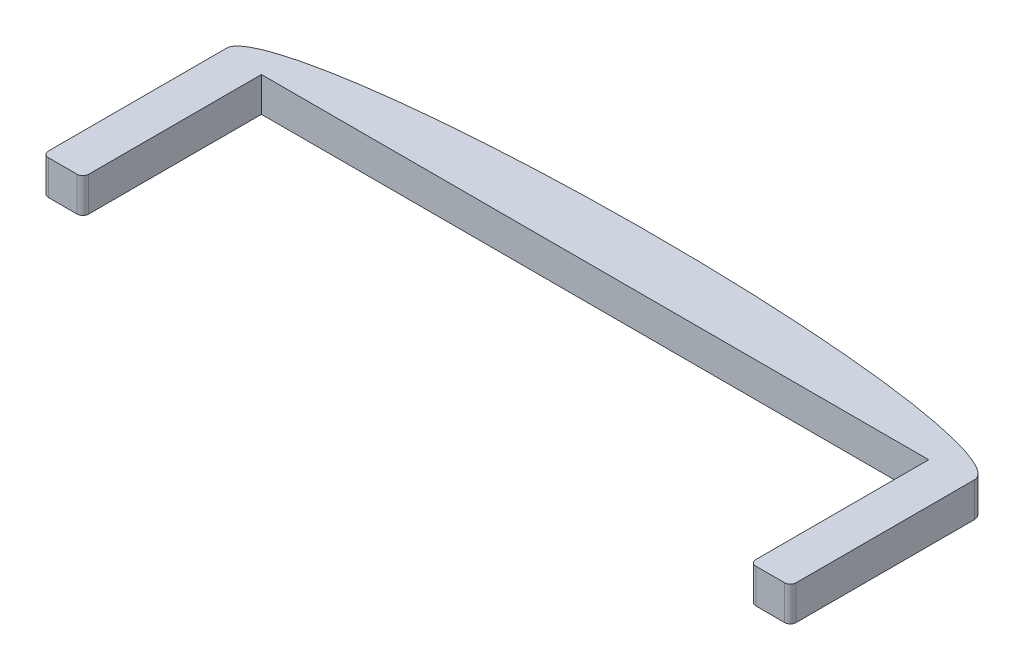
ISO-10303-21;
HEADER;
FILE_DESCRIPTION(('STEP AP214'),'2;1');
FILE_NAME('part.step','',(''),(''),'','','');
FILE_SCHEMA(('AUTOMOTIVE_DESIGN { 1 0 10303 214 1 1 1 1 }'));
ENDSEC;
DATA;
#1=APPLICATION_CONTEXT('core data for automotive mechanical design processes');
#2=APPLICATION_PROTOCOL_DEFINITION('international standard','automotive_design',2000,#1);
#3=PRODUCT_CONTEXT('',#1,'mechanical');
#4=PRODUCT('Part','Part','',(#3));
#5=PRODUCT_RELATED_PRODUCT_CATEGORY('part','',(#4));
#6=PRODUCT_DEFINITION_FORMATION('','',#4);
#7=PRODUCT_DEFINITION_CONTEXT('part definition',#1,'design');
#8=PRODUCT_DEFINITION('design','',#6,#7);
#9=PRODUCT_DEFINITION_SHAPE('','',#8);
#10=(LENGTH_UNIT() NAMED_UNIT(*) SI_UNIT(.MILLI.,.METRE.));
#11=(NAMED_UNIT(*) PLANE_ANGLE_UNIT() SI_UNIT($,.RADIAN.));
#12=(NAMED_UNIT(*) SI_UNIT($,.STERADIAN.) SOLID_ANGLE_UNIT());
#13=UNCERTAINTY_MEASURE_WITH_UNIT(LENGTH_MEASURE(1.E-05),#10,'distance_accuracy_value','');
#14=(GEOMETRIC_REPRESENTATION_CONTEXT(3) GLOBAL_UNCERTAINTY_ASSIGNED_CONTEXT((#13)) GLOBAL_UNIT_ASSIGNED_CONTEXT((#10,
#11,#12)) REPRESENTATION_CONTEXT('',''));
#15=CARTESIAN_POINT('',(0.,0.,0.));
#16=DIRECTION('',(0.,0.,1.));
#17=DIRECTION('',(1.,0.,0.));
#18=AXIS2_PLACEMENT_3D('',#15,#16,#17);
#19=CARTESIAN_POINT('',(0.,3.,0.));
#20=DIRECTION('',(0.,0.,-1.));
#21=DIRECTION('',(-1.,0.,0.));
#22=AXIS2_PLACEMENT_3D('',#19,#20,#21);
#23=PLANE('',#22);
#24=DIRECTION('',(1.,0.,0.));
#25=VECTOR('',#24,1.);
#26=CARTESIAN_POINT('',(0.,3.,0.));
#27=LINE('',#26,#25);
#28=CARTESIAN_POINT('',(29.5,3.,0.));
#29=VERTEX_POINT('',#28);
#30=CARTESIAN_POINT('',(32.,3.,0.));
#31=VERTEX_POINT('',#30);
#32=EDGE_CURVE('E237',#29,#31,#27,.T.);
#33=ORIENTED_EDGE('',*,*,#32,.F.);
#34=DIRECTION('',(0.,-1.,0.));
#35=VECTOR('',#34,1.);
#36=CARTESIAN_POINT('',(29.5,3.,0.));
#37=LINE('',#36,#35);
#38=CARTESIAN_POINT('',(29.5,0.,0.));
#39=VERTEX_POINT('',#38);
#40=EDGE_CURVE('E43',#29,#39,#37,.T.);
#41=ORIENTED_EDGE('',*,*,#40,.T.);
#42=DIRECTION('',(1.,0.,0.));
#43=VECTOR('',#42,1.);
#44=CARTESIAN_POINT('',(0.,0.,0.));
#45=LINE('',#44,#43);
#46=CARTESIAN_POINT('',(32.,0.,0.));
#47=VERTEX_POINT('',#46);
#48=EDGE_CURVE('E223',#39,#47,#45,.T.);
#49=ORIENTED_EDGE('',*,*,#48,.T.);
#50=DIRECTION('',(0.,-1.,0.));
#51=VECTOR('',#50,1.);
#52=CARTESIAN_POINT('',(32.,3.,0.));
#53=LINE('',#52,#51);
#54=EDGE_CURVE('E256',#47,#31,#53,.F.);
#55=ORIENTED_EDGE('',*,*,#54,.T.);
#56=EDGE_LOOP('',(#33,#41,#49,#55));
#57=FACE_BOUND('',#56,.T.);
#58=ADVANCED_FACE('F35',(#57),#23,.F.);
#59=CARTESIAN_POINT('',(0.,3.,-16.));
#60=DIRECTION('',(0.,1.,0.));
#61=DIRECTION('',(-1.,0.,0.));
#62=AXIS2_PLACEMENT_3D('',#59,#60,#61);
#63=ELLIPSE('',#62,32.5,4.5);
#64=DIRECTION('',(0.,-1.,0.));
#65=VECTOR('',#64,1.);
#66=SURFACE_OF_LINEAR_EXTRUSION('',#63,#65);
#67=CARTESIAN_POINT('',(0.,0.,-16.));
#68=DIRECTION('',(0.,1.,0.));
#69=DIRECTION('',(-1.,0.,0.));
#70=AXIS2_PLACEMENT_3D('',#67,#68,#69);
#71=ELLIPSE('',#70,32.5,4.5);
#72=CARTESIAN_POINT('',(32.5,0.,-16.));
#73=VERTEX_POINT('',#72);
#74=CARTESIAN_POINT('',(-32.5,0.,-16.));
#75=VERTEX_POINT('',#74);
#76=EDGE_CURVE('E165',#73,#75,#71,.T.);
#77=ORIENTED_EDGE('',*,*,#76,.T.);
#78=DIRECTION('',(0.,-1.,0.));
#79=VECTOR('',#78,1.);
#80=CARTESIAN_POINT('',(-32.5,3.,-16.));
#81=LINE('',#80,#79);
#82=CARTESIAN_POINT('',(-32.5,3.,-16.));
#83=VERTEX_POINT('',#82);
#84=EDGE_CURVE('E246',#83,#75,#81,.T.);
#85=ORIENTED_EDGE('',*,*,#84,.F.);
#86=CARTESIAN_POINT('',(32.5,3.,-16.));
#87=VERTEX_POINT('',#86);
#88=EDGE_CURVE('E166',#87,#83,#63,.T.);
#89=ORIENTED_EDGE('',*,*,#88,.F.);
#90=DIRECTION('',(0.,-1.,0.));
#91=VECTOR('',#90,1.);
#92=CARTESIAN_POINT('',(32.5,3.,-16.));
#93=LINE('',#92,#91);
#94=EDGE_CURVE('E160',#87,#73,#93,.T.);
#95=ORIENTED_EDGE('',*,*,#94,.T.);
#96=EDGE_LOOP('',(#77,#85,#89,#95));
#97=FACE_BOUND('',#96,.T.);
#98=ADVANCED_FACE('F173',(#97),#66,.F.);
#99=CARTESIAN_POINT('',(-32.5,3.,0.));
#100=DIRECTION('',(1.,0.,0.));
#101=DIRECTION('',(0.,0.,-1.));
#102=AXIS2_PLACEMENT_3D('',#99,#100,#101);
#103=PLANE('',#102);
#104=DIRECTION('',(0.,0.,1.));
#105=VECTOR('',#104,1.);
#106=CARTESIAN_POINT('',(-32.5,0.,0.));
#107=LINE('',#106,#105);
#108=CARTESIAN_POINT('',(-32.5,0.,-0.499999999999996));
#109=VERTEX_POINT('',#108);
#110=EDGE_CURVE('E241',#75,#109,#107,.T.);
#111=ORIENTED_EDGE('',*,*,#110,.T.);
#112=DIRECTION('',(0.,-1.,0.));
#113=VECTOR('',#112,1.);
#114=CARTESIAN_POINT('',(-32.5,3.,-0.499999999999996));
#115=LINE('',#114,#113);
#116=CARTESIAN_POINT('',(-32.5,3.,-0.499999999999996));
#117=VERTEX_POINT('',#116);
#118=EDGE_CURVE('E263',#109,#117,#115,.F.);
#119=ORIENTED_EDGE('',*,*,#118,.T.);
#120=DIRECTION('',(0.,0.,1.));
#121=VECTOR('',#120,1.);
#122=CARTESIAN_POINT('',(-32.5,3.,0.));
#123=LINE('',#122,#121);
#124=EDGE_CURVE('E169',#83,#117,#123,.T.);
#125=ORIENTED_EDGE('',*,*,#124,.F.);
#126=ORIENTED_EDGE('',*,*,#84,.T.);
#127=EDGE_LOOP('',(#111,#119,#125,#126));
#128=FACE_BOUND('',#127,.T.);
#129=ADVANCED_FACE('F177',(#128),#103,.F.);
#130=CARTESIAN_POINT('',(-32.,0.,0.));
#131=VERTEX_POINT('',#130);
#132=CARTESIAN_POINT('',(-29.5,0.,0.));
#133=VERTEX_POINT('',#132);
#134=EDGE_CURVE('E170',#131,#133,#45,.T.);
#135=ORIENTED_EDGE('',*,*,#134,.T.);
#136=DIRECTION('',(0.,-1.,0.));
#137=VECTOR('',#136,1.);
#138=CARTESIAN_POINT('',(-29.5,3.,0.));
#139=LINE('',#138,#137);
#140=CARTESIAN_POINT('',(-29.5,3.,0.));
#141=VERTEX_POINT('',#140);
#142=EDGE_CURVE('E219',#133,#141,#139,.F.);
#143=ORIENTED_EDGE('',*,*,#142,.T.);
#144=CARTESIAN_POINT('',(-32.,3.,0.));
#145=VERTEX_POINT('',#144);
#146=EDGE_CURVE('E250',#145,#141,#27,.T.);
#147=ORIENTED_EDGE('',*,*,#146,.F.);
#148=DIRECTION('',(0.,-1.,0.));
#149=VECTOR('',#148,1.);
#150=CARTESIAN_POINT('',(-32.,3.,0.));
#151=LINE('',#150,#149);
#152=EDGE_CURVE('E221',#145,#131,#151,.T.);
#153=ORIENTED_EDGE('',*,*,#152,.T.);
#154=EDGE_LOOP('',(#135,#143,#147,#153));
#155=FACE_BOUND('',#154,.T.);
#156=ADVANCED_FACE('F200',(#155),#23,.F.);
#157=CARTESIAN_POINT('',(0.,3.,-16.));
#158=DIRECTION('',(0.,1.,0.));
#159=DIRECTION('',(0.,0.,1.));
#160=AXIS2_PLACEMENT_3D('',#157,#158,#159);
#161=PLANE('',#160);
#162=ORIENTED_EDGE('',*,*,#146,.T.);
#163=CARTESIAN_POINT('',(-29.5,3.,-0.499999999999996));
#164=DIRECTION('',(0.,1.,0.));
#165=DIRECTION('',(0.,0.,1.));
#166=AXIS2_PLACEMENT_3D('',#163,#164,#165);
#167=CIRCLE('',#166,0.5);
#168=CARTESIAN_POINT('',(-29.,3.,-0.499999999999996));
#169=VERTEX_POINT('',#168);
#170=EDGE_CURVE('E130',#141,#169,#167,.T.);
#171=ORIENTED_EDGE('',*,*,#170,.T.);
#172=DIRECTION('',(0.,0.,-1.));
#173=VECTOR('',#172,1.);
#174=CARTESIAN_POINT('',(-29.,3.,-1.82150000000006));
#175=LINE('',#174,#173);
#176=CARTESIAN_POINT('',(-29.,3.,-15.5215000000001));
#177=VERTEX_POINT('',#176);
#178=EDGE_CURVE('E123',#169,#177,#175,.T.);
#179=ORIENTED_EDGE('',*,*,#178,.T.);
#180=DIRECTION('',(1.,0.,0.));
#181=VECTOR('',#180,1.);
#182=CARTESIAN_POINT('',(29.,3.,-15.5215000000001));
#183=LINE('',#182,#181);
#184=CARTESIAN_POINT('',(29.,3.,-15.5215000000001));
#185=VERTEX_POINT('',#184);
#186=EDGE_CURVE('E128',#177,#185,#183,.T.);
#187=ORIENTED_EDGE('',*,*,#186,.T.);
#188=DIRECTION('',(0.,0.,1.));
#189=VECTOR('',#188,1.);
#190=CARTESIAN_POINT('',(29.,3.,-1.82150000000006));
#191=LINE('',#190,#189);
#192=CARTESIAN_POINT('',(29.,3.,-0.500000000000004));
#193=VERTEX_POINT('',#192);
#194=EDGE_CURVE('E134',#185,#193,#191,.T.);
#195=ORIENTED_EDGE('',*,*,#194,.T.);
#196=CARTESIAN_POINT('',(29.5,3.,-0.500000000000004));
#197=DIRECTION('',(0.,1.,0.));
#198=DIRECTION('',(0.,0.,1.));
#199=AXIS2_PLACEMENT_3D('',#196,#197,#198);
#200=CIRCLE('',#199,0.5);
#201=EDGE_CURVE('E50',#193,#29,#200,.T.);
#202=ORIENTED_EDGE('',*,*,#201,.T.);
#203=ORIENTED_EDGE('',*,*,#32,.T.);
#204=CARTESIAN_POINT('',(32.,3.,-0.500000000000004));
#205=DIRECTION('',(0.,1.,0.));
#206=DIRECTION('',(0.,0.,1.));
#207=AXIS2_PLACEMENT_3D('',#204,#205,#206);
#208=CIRCLE('',#207,0.5);
#209=CARTESIAN_POINT('',(32.5,3.,-0.500000000000004));
#210=VERTEX_POINT('',#209);
#211=EDGE_CURVE('E260',#31,#210,#208,.T.);
#212=ORIENTED_EDGE('',*,*,#211,.T.);
#213=DIRECTION('',(0.,0.,1.));
#214=VECTOR('',#213,1.);
#215=CARTESIAN_POINT('',(32.5,3.,0.));
#216=LINE('',#215,#214);
#217=EDGE_CURVE('E157',#87,#210,#216,.T.);
#218=ORIENTED_EDGE('',*,*,#217,.F.);
#219=ORIENTED_EDGE('',*,*,#88,.T.);
#220=ORIENTED_EDGE('',*,*,#124,.T.);
#221=CARTESIAN_POINT('',(-32.,3.,-0.499999999999996));
#222=DIRECTION('',(0.,1.,0.));
#223=DIRECTION('',(0.,0.,1.));
#224=AXIS2_PLACEMENT_3D('',#221,#222,#223);
#225=CIRCLE('',#224,0.5);
#226=EDGE_CURVE('E258',#117,#145,#225,.T.);
#227=ORIENTED_EDGE('',*,*,#226,.T.);
#228=EDGE_LOOP('',(#162,#171,#179,#187,#195,#202,#203,#212,#218,#219,#220,#227));
#229=FACE_BOUND('',#228,.T.);
#230=ADVANCED_FACE('F126',(#229),#161,.T.);
#231=CARTESIAN_POINT('',(0.,0.,-16.));
#232=DIRECTION('',(0.,1.,0.));
#233=DIRECTION('',(0.,0.,1.));
#234=AXIS2_PLACEMENT_3D('',#231,#232,#233);
#235=PLANE('',#234);
#236=DIRECTION('',(0.,0.,-1.));
#237=VECTOR('',#236,1.);
#238=CARTESIAN_POINT('',(-29.,0.,-1.82150000000006));
#239=LINE('',#238,#237);
#240=CARTESIAN_POINT('',(-29.,0.,-0.499999999999997));
#241=VERTEX_POINT('',#240);
#242=CARTESIAN_POINT('',(-29.,0.,-15.5215000000001));
#243=VERTEX_POINT('',#242);
#244=EDGE_CURVE('E140',#241,#243,#239,.T.);
#245=ORIENTED_EDGE('',*,*,#244,.F.);
#246=CARTESIAN_POINT('',(-29.5,0.,-0.499999999999996));
#247=DIRECTION('',(0.,1.,0.));
#248=DIRECTION('',(0.,0.,1.));
#249=AXIS2_PLACEMENT_3D('',#246,#247,#248);
#250=CIRCLE('',#249,0.5);
#251=EDGE_CURVE('E225',#241,#133,#250,.F.);
#252=ORIENTED_EDGE('',*,*,#251,.T.);
#253=ORIENTED_EDGE('',*,*,#134,.F.);
#254=CARTESIAN_POINT('',(-32.,0.,-0.499999999999996));
#255=DIRECTION('',(0.,1.,0.));
#256=DIRECTION('',(0.,0.,1.));
#257=AXIS2_PLACEMENT_3D('',#254,#255,#256);
#258=CIRCLE('',#257,0.5);
#259=EDGE_CURVE('E253',#131,#109,#258,.F.);
#260=ORIENTED_EDGE('',*,*,#259,.T.);
#261=ORIENTED_EDGE('',*,*,#110,.F.);
#262=ORIENTED_EDGE('',*,*,#76,.F.);
#263=DIRECTION('',(0.,0.,1.));
#264=VECTOR('',#263,1.);
#265=CARTESIAN_POINT('',(32.5,0.,0.));
#266=LINE('',#265,#264);
#267=CARTESIAN_POINT('',(32.5,0.,-0.500000000000004));
#268=VERTEX_POINT('',#267);
#269=EDGE_CURVE('E155',#73,#268,#266,.T.);
#270=ORIENTED_EDGE('',*,*,#269,.T.);
#271=CARTESIAN_POINT('',(32.,0.,-0.500000000000004));
#272=DIRECTION('',(0.,1.,0.));
#273=DIRECTION('',(0.,0.,1.));
#274=AXIS2_PLACEMENT_3D('',#271,#272,#273);
#275=CIRCLE('',#274,0.5);
#276=EDGE_CURVE('E239',#268,#47,#275,.F.);
#277=ORIENTED_EDGE('',*,*,#276,.T.);
#278=ORIENTED_EDGE('',*,*,#48,.F.);
#279=CARTESIAN_POINT('',(29.5,0.,-0.500000000000004));
#280=DIRECTION('',(0.,1.,0.));
#281=DIRECTION('',(0.,0.,1.));
#282=AXIS2_PLACEMENT_3D('',#279,#280,#281);
#283=CIRCLE('',#282,0.5);
#284=CARTESIAN_POINT('',(29.,0.,-0.500000000000004));
#285=VERTEX_POINT('',#284);
#286=EDGE_CURVE('E228',#39,#285,#283,.F.);
#287=ORIENTED_EDGE('',*,*,#286,.T.);
#288=DIRECTION('',(0.,0.,1.));
#289=VECTOR('',#288,1.);
#290=CARTESIAN_POINT('',(29.,0.,-1.82150000000006));
#291=LINE('',#290,#289);
#292=CARTESIAN_POINT('',(29.,0.,-15.5215000000001));
#293=VERTEX_POINT('',#292);
#294=EDGE_CURVE('E150',#293,#285,#291,.T.);
#295=ORIENTED_EDGE('',*,*,#294,.F.);
#296=DIRECTION('',(1.,0.,0.));
#297=VECTOR('',#296,1.);
#298=CARTESIAN_POINT('',(29.,0.,-15.5215000000001));
#299=LINE('',#298,#297);
#300=EDGE_CURVE('E153',#243,#293,#299,.T.);
#301=ORIENTED_EDGE('',*,*,#300,.F.);
#302=EDGE_LOOP('',(#245,#252,#253,#260,#261,#262,#270,#277,#278,#287,#295,#301));
#303=FACE_BOUND('',#302,.T.);
#304=ADVANCED_FACE('F210',(#303),#235,.F.);
#305=CARTESIAN_POINT('',(32.5,3.,0.));
#306=DIRECTION('',(1.,0.,0.));
#307=DIRECTION('',(0.,0.,-1.));
#308=AXIS2_PLACEMENT_3D('',#305,#306,#307);
#309=PLANE('',#308);
#310=ORIENTED_EDGE('',*,*,#217,.T.);
#311=DIRECTION('',(0.,-1.,0.));
#312=VECTOR('',#311,1.);
#313=CARTESIAN_POINT('',(32.5,0.,-0.500000000000004));
#314=LINE('',#313,#312);
#315=EDGE_CURVE('E249',#210,#268,#314,.T.);
#316=ORIENTED_EDGE('',*,*,#315,.T.);
#317=ORIENTED_EDGE('',*,*,#269,.F.);
#318=ORIENTED_EDGE('',*,*,#94,.F.);
#319=EDGE_LOOP('',(#310,#316,#317,#318));
#320=FACE_BOUND('',#319,.T.);
#321=ADVANCED_FACE('F184',(#320),#309,.T.);
#322=CARTESIAN_POINT('',(32.,3.,-0.500000000000004));
#323=DIRECTION('',(0.,1.,0.));
#324=DIRECTION('',(0.,0.,1.));
#325=AXIS2_PLACEMENT_3D('',#322,#323,#324);
#326=CYLINDRICAL_SURFACE('',#325,0.5);
#327=ORIENTED_EDGE('',*,*,#211,.F.);
#328=ORIENTED_EDGE('',*,*,#54,.F.);
#329=ORIENTED_EDGE('',*,*,#276,.F.);
#330=ORIENTED_EDGE('',*,*,#315,.F.);
#331=EDGE_LOOP('',(#327,#328,#329,#330));
#332=FACE_BOUND('',#331,.T.);
#333=ADVANCED_FACE('F180',(#332),#326,.T.);
#334=CARTESIAN_POINT('',(-32.,3.,-0.499999999999996));
#335=DIRECTION('',(0.,-1.,0.));
#336=DIRECTION('',(0.,0.,-1.));
#337=AXIS2_PLACEMENT_3D('',#334,#335,#336);
#338=CYLINDRICAL_SURFACE('',#337,0.5);
#339=ORIENTED_EDGE('',*,*,#226,.F.);
#340=ORIENTED_EDGE('',*,*,#118,.F.);
#341=ORIENTED_EDGE('',*,*,#259,.F.);
#342=ORIENTED_EDGE('',*,*,#152,.F.);
#343=EDGE_LOOP('',(#339,#340,#341,#342));
#344=FACE_BOUND('',#343,.T.);
#345=ADVANCED_FACE('F183',(#344),#338,.T.);
#346=CARTESIAN_POINT('',(29.,3.,-15.5215000000001));
#347=DIRECTION('',(0.,0.,-1.));
#348=DIRECTION('',(-1.,0.,0.));
#349=AXIS2_PLACEMENT_3D('',#346,#347,#348);
#350=PLANE('',#349);
#351=ORIENTED_EDGE('',*,*,#300,.T.);
#352=DIRECTION('',(0.,-1.,0.));
#353=VECTOR('',#352,1.);
#354=CARTESIAN_POINT('',(29.,3.,-15.5215000000001));
#355=LINE('',#354,#353);
#356=EDGE_CURVE('E143',#185,#293,#355,.T.);
#357=ORIENTED_EDGE('',*,*,#356,.F.);
#358=ORIENTED_EDGE('',*,*,#186,.F.);
#359=DIRECTION('',(0.,-1.,0.));
#360=VECTOR('',#359,1.);
#361=CARTESIAN_POINT('',(-29.,3.,-15.5215000000001));
#362=LINE('',#361,#360);
#363=EDGE_CURVE('E137',#177,#243,#362,.T.);
#364=ORIENTED_EDGE('',*,*,#363,.T.);
#365=EDGE_LOOP('',(#351,#357,#358,#364));
#366=FACE_BOUND('',#365,.T.);
#367=ADVANCED_FACE('F145',(#366),#350,.F.);
#368=CARTESIAN_POINT('',(-29.,3.,-1.82150000000006));
#369=DIRECTION('',(-1.,0.,0.));
#370=DIRECTION('',(0.,0.,1.));
#371=AXIS2_PLACEMENT_3D('',#368,#369,#370);
#372=PLANE('',#371);
#373=ORIENTED_EDGE('',*,*,#178,.F.);
#374=DIRECTION('',(0.,-1.,0.));
#375=VECTOR('',#374,1.);
#376=CARTESIAN_POINT('',(-29.,3.,-0.499999999999996));
#377=LINE('',#376,#375);
#378=EDGE_CURVE('E265',#169,#241,#377,.T.);
#379=ORIENTED_EDGE('',*,*,#378,.T.);
#380=ORIENTED_EDGE('',*,*,#244,.T.);
#381=ORIENTED_EDGE('',*,*,#363,.F.);
#382=EDGE_LOOP('',(#373,#379,#380,#381));
#383=FACE_BOUND('',#382,.T.);
#384=ADVANCED_FACE('F138',(#383),#372,.F.);
#385=CARTESIAN_POINT('',(29.,3.,-1.82150000000006));
#386=DIRECTION('',(1.,0.,0.));
#387=DIRECTION('',(0.,0.,-1.));
#388=AXIS2_PLACEMENT_3D('',#385,#386,#387);
#389=PLANE('',#388);
#390=ORIENTED_EDGE('',*,*,#294,.T.);
#391=DIRECTION('',(0.,-1.,0.));
#392=VECTOR('',#391,1.);
#393=CARTESIAN_POINT('',(29.,3.,-0.500000000000004));
#394=LINE('',#393,#392);
#395=EDGE_CURVE('E11',#285,#193,#394,.F.);
#396=ORIENTED_EDGE('',*,*,#395,.T.);
#397=ORIENTED_EDGE('',*,*,#194,.F.);
#398=ORIENTED_EDGE('',*,*,#356,.T.);
#399=EDGE_LOOP('',(#390,#396,#397,#398));
#400=FACE_BOUND('',#399,.T.);
#401=ADVANCED_FACE('F190',(#400),#389,.F.);
#402=CARTESIAN_POINT('',(-29.5,3.,-0.499999999999996));
#403=DIRECTION('',(0.,-1.,0.));
#404=DIRECTION('',(0.,0.,-1.));
#405=AXIS2_PLACEMENT_3D('',#402,#403,#404);
#406=CYLINDRICAL_SURFACE('',#405,0.5);
#407=ORIENTED_EDGE('',*,*,#170,.F.);
#408=ORIENTED_EDGE('',*,*,#142,.F.);
#409=ORIENTED_EDGE('',*,*,#251,.F.);
#410=ORIENTED_EDGE('',*,*,#378,.F.);
#411=EDGE_LOOP('',(#407,#408,#409,#410));
#412=FACE_BOUND('',#411,.T.);
#413=ADVANCED_FACE('F188',(#412),#406,.T.);
#414=CARTESIAN_POINT('',(29.5,3.,-0.500000000000004));
#415=DIRECTION('',(0.,-1.,0.));
#416=DIRECTION('',(0.,0.,-1.));
#417=AXIS2_PLACEMENT_3D('',#414,#415,#416);
#418=CYLINDRICAL_SURFACE('',#417,0.5);
#419=ORIENTED_EDGE('',*,*,#201,.F.);
#420=ORIENTED_EDGE('',*,*,#395,.F.);
#421=ORIENTED_EDGE('',*,*,#286,.F.);
#422=ORIENTED_EDGE('',*,*,#40,.F.);
#423=EDGE_LOOP('',(#419,#420,#421,#422));
#424=FACE_BOUND('',#423,.T.);
#425=ADVANCED_FACE('F37',(#424),#418,.T.);
#426=CLOSED_SHELL('',(#58,#98,#129,#156,#230,#304,#321,#333,#345,#367,#384,#401,#413,#425));
#427=MANIFOLD_SOLID_BREP('B2',#426);
#428=ADVANCED_BREP_SHAPE_REPRESENTATION('',(#18,#427),#14);
#429=SHAPE_DEFINITION_REPRESENTATION(#9,#428);
ENDSEC;
END-ISO-10303-21;
